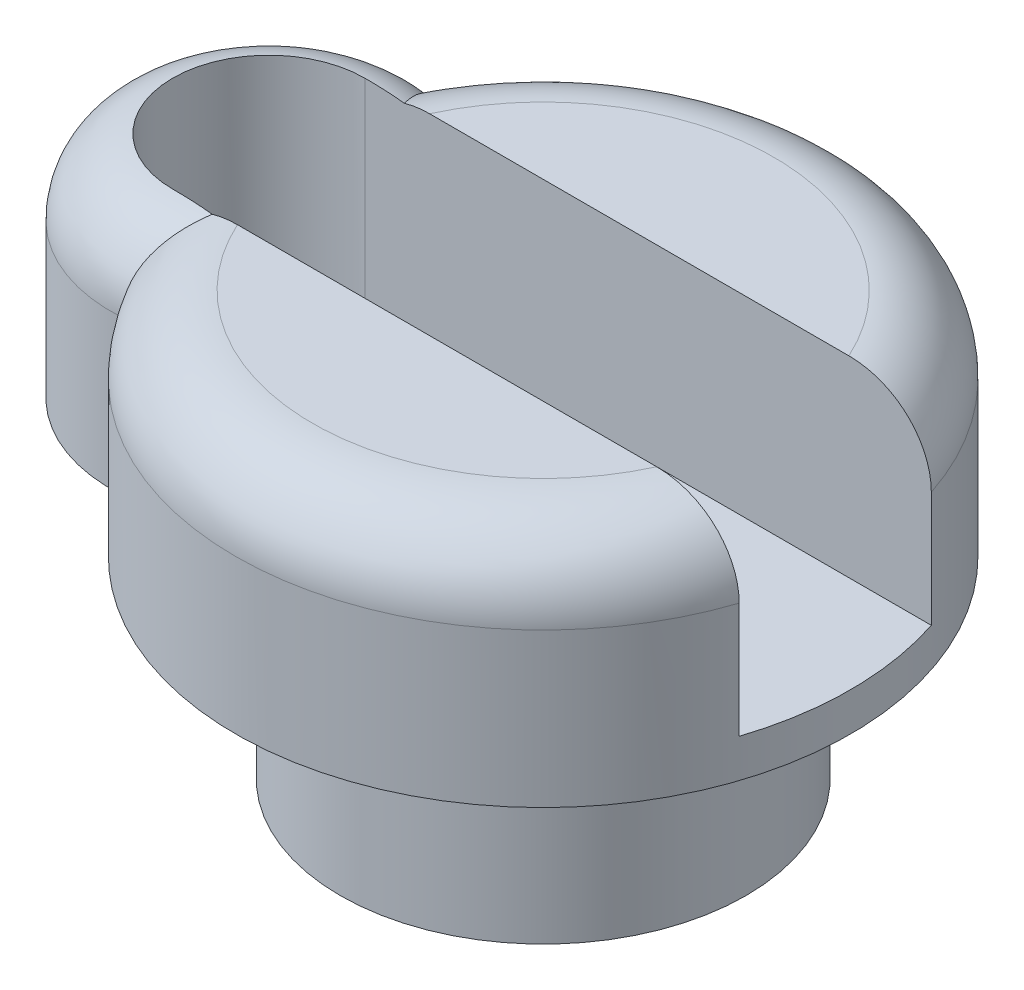
ISO-10303-21;
HEADER;
FILE_DESCRIPTION(('STEP AP214'),'2;1');
FILE_NAME('part.step','',(''),(''),'','','');
FILE_SCHEMA(('AUTOMOTIVE_DESIGN { 1 0 10303 214 1 1 1 1 }'));
ENDSEC;
DATA;
#1=APPLICATION_CONTEXT('core data for automotive mechanical design processes');
#2=APPLICATION_PROTOCOL_DEFINITION('international standard','automotive_design',2000,#1);
#3=PRODUCT_CONTEXT('',#1,'mechanical');
#4=PRODUCT('Part','Part','',(#3));
#5=PRODUCT_RELATED_PRODUCT_CATEGORY('part','',(#4));
#6=PRODUCT_DEFINITION_FORMATION('','',#4);
#7=PRODUCT_DEFINITION_CONTEXT('part definition',#1,'design');
#8=PRODUCT_DEFINITION('design','',#6,#7);
#9=PRODUCT_DEFINITION_SHAPE('','',#8);
#10=(LENGTH_UNIT() NAMED_UNIT(*) SI_UNIT(.MILLI.,.METRE.));
#11=(NAMED_UNIT(*) PLANE_ANGLE_UNIT() SI_UNIT($,.RADIAN.));
#12=(NAMED_UNIT(*) SI_UNIT($,.STERADIAN.) SOLID_ANGLE_UNIT());
#13=UNCERTAINTY_MEASURE_WITH_UNIT(LENGTH_MEASURE(1.E-05),#10,'distance_accuracy_value','');
#14=(GEOMETRIC_REPRESENTATION_CONTEXT(3) GLOBAL_UNCERTAINTY_ASSIGNED_CONTEXT((#13)) GLOBAL_UNIT_ASSIGNED_CONTEXT((#10,
#11,#12)) REPRESENTATION_CONTEXT('',''));
#15=CARTESIAN_POINT('',(0.,0.,0.));
#16=DIRECTION('',(0.,0.,1.));
#17=DIRECTION('',(1.,0.,0.));
#18=AXIS2_PLACEMENT_3D('',#15,#16,#17);
#19=CARTESIAN_POINT('',(0.,6.985,0.));
#20=DIRECTION('',(0.,1.,0.));
#21=DIRECTION('',(0.,0.,1.));
#22=AXIS2_PLACEMENT_3D('',#19,#20,#21);
#23=PLANE('',#22);
#24=DIRECTION('',(1.,0.,0.));
#25=VECTOR('',#24,1.);
#26=CARTESIAN_POINT('',(0.,6.985,-1.5875));
#27=LINE('',#26,#25);
#28=CARTESIAN_POINT('',(-3.46351609639684,6.985,-1.5875));
#29=VERTEX_POINT('',#28);
#30=CARTESIAN_POINT('',(3.46351609639684,6.985,-1.5875));
#31=VERTEX_POINT('',#30);
#32=EDGE_CURVE('E161',#29,#31,#27,.T.);
#33=ORIENTED_EDGE('',*,*,#32,.T.);
#34=CARTESIAN_POINT('',(0.,6.985,0.));
#35=DIRECTION('',(0.,1.,0.));
#36=DIRECTION('',(0.,0.,1.));
#37=AXIS2_PLACEMENT_3D('',#34,#35,#36);
#38=CIRCLE('',#37,3.81);
#39=EDGE_CURVE('E265',#31,#29,#38,.T.);
#40=ORIENTED_EDGE('',*,*,#39,.T.);
#41=EDGE_LOOP('',(#33,#40));
#42=FACE_BOUND('',#41,.T.);
#43=ADVANCED_FACE('F36',(#42),#23,.T.);
#44=CARTESIAN_POINT('',(0.,6.985,0.));
#45=DIRECTION('',(0.,-1.,0.));
#46=DIRECTION('',(0.,0.,-1.));
#47=AXIS2_PLACEMENT_3D('',#44,#45,#46);
#48=CYLINDRICAL_SURFACE('',#47,5.08);
#49=CARTESIAN_POINT('',(0.,3.81,0.));
#50=DIRECTION('',(0.,1.,0.));
#51=DIRECTION('',(0.,0.,1.));
#52=AXIS2_PLACEMENT_3D('',#49,#50,#51);
#53=CIRCLE('',#52,5.08);
#54=CARTESIAN_POINT('',(-4.8349792340776,3.81,-1.5586455036468));
#55=VERTEX_POINT('',#54);
#56=CARTESIAN_POINT('',(-4.8349792340776,3.81,1.5586455036468));
#57=VERTEX_POINT('',#56);
#58=EDGE_CURVE('E150',#55,#57,#53,.T.);
#59=ORIENTED_EDGE('',*,*,#58,.F.);
#60=DIRECTION('',(0.,1.,0.));
#61=VECTOR('',#60,1.);
#62=CARTESIAN_POINT('',(-4.8349792340776,-2.72379220451205,-1.5586455036468));
#63=LINE('',#62,#61);
#64=CARTESIAN_POINT('',(-4.8349792340776,3.175,-1.5586455036468));
#65=VERTEX_POINT('',#64);
#66=EDGE_CURVE('E149',#65,#55,#63,.T.);
#67=ORIENTED_EDGE('',*,*,#66,.F.);
#68=CARTESIAN_POINT('',(0.,3.175,0.));
#69=DIRECTION('',(0.,1.,0.));
#70=DIRECTION('',(0.,0.,1.));
#71=AXIS2_PLACEMENT_3D('',#68,#69,#70);
#72=CIRCLE('',#71,5.08);
#73=CARTESIAN_POINT('',(-4.8349792340776,3.175,1.5586455036468));
#74=VERTEX_POINT('',#73);
#75=EDGE_CURVE('E189',#65,#74,#72,.T.);
#76=ORIENTED_EDGE('',*,*,#75,.T.);
#77=DIRECTION('',(0.,1.,0.));
#78=VECTOR('',#77,1.);
#79=CARTESIAN_POINT('',(-4.8349792340776,-2.72379220451205,1.5586455036468));
#80=LINE('',#79,#78);
#81=EDGE_CURVE('E178',#74,#57,#80,.T.);
#82=ORIENTED_EDGE('',*,*,#81,.T.);
#83=EDGE_LOOP('',(#59,#67,#76,#82));
#84=FACE_BOUND('',#83,.T.);
#85=ADVANCED_FACE('F288',(#84),#48,.T.);
#86=DIRECTION('',(0.,1.,0.));
#87=VECTOR('',#86,1.);
#88=CARTESIAN_POINT('',(-4.36537675030158,-2.72379220451205,-2.59805423883459));
#89=LINE('',#88,#87);
#90=CARTESIAN_POINT('',(-4.36537675030158,3.175,-2.59805423883459));
#91=VERTEX_POINT('',#90);
#92=CARTESIAN_POINT('',(-4.36537675030158,5.715,-2.59805423883459));
#93=VERTEX_POINT('',#92);
#94=EDGE_CURVE('E168',#91,#93,#89,.T.);
#95=ORIENTED_EDGE('',*,*,#94,.T.);
#96=CARTESIAN_POINT('',(0.,5.715,0.));
#97=DIRECTION('',(0.,1.,0.));
#98=DIRECTION('',(0.,0.,1.));
#99=AXIS2_PLACEMENT_3D('',#96,#97,#98);
#100=CIRCLE('',#99,5.08);
#101=CARTESIAN_POINT('',(4.82558221875869,5.715,-1.5875));
#102=VERTEX_POINT('',#101);
#103=EDGE_CURVE('E11',#93,#102,#100,.F.);
#104=ORIENTED_EDGE('',*,*,#103,.T.);
#105=DIRECTION('',(0.,1.,0.));
#106=VECTOR('',#105,1.);
#107=CARTESIAN_POINT('',(4.82558221875869,3.81,-1.5875));
#108=LINE('',#107,#106);
#109=CARTESIAN_POINT('',(4.82558221875869,3.81,-1.5875));
#110=VERTEX_POINT('',#109);
#111=EDGE_CURVE('E166',#110,#102,#108,.T.);
#112=ORIENTED_EDGE('',*,*,#111,.F.);
#113=CARTESIAN_POINT('',(0.,3.81,0.));
#114=DIRECTION('',(0.,1.,0.));
#115=DIRECTION('',(0.,0.,1.));
#116=AXIS2_PLACEMENT_3D('',#113,#114,#115);
#117=CIRCLE('',#116,5.08);
#118=CARTESIAN_POINT('',(4.82558221875869,3.81,1.5875));
#119=VERTEX_POINT('',#118);
#120=EDGE_CURVE('E135',#119,#110,#117,.T.);
#121=ORIENTED_EDGE('',*,*,#120,.F.);
#122=DIRECTION('',(0.,1.,0.));
#123=VECTOR('',#122,1.);
#124=CARTESIAN_POINT('',(4.82558221875869,3.81,1.5875));
#125=LINE('',#124,#123);
#126=CARTESIAN_POINT('',(4.82558221875869,5.715,1.5875));
#127=VERTEX_POINT('',#126);
#128=EDGE_CURVE('E169',#119,#127,#125,.T.);
#129=ORIENTED_EDGE('',*,*,#128,.T.);
#130=CARTESIAN_POINT('',(0.,5.715,0.));
#131=DIRECTION('',(0.,1.,0.));
#132=DIRECTION('',(0.,0.,1.));
#133=AXIS2_PLACEMENT_3D('',#130,#131,#132);
#134=CIRCLE('',#133,5.08);
#135=CARTESIAN_POINT('',(-4.36537675030158,5.715,2.59805423883459));
#136=VERTEX_POINT('',#135);
#137=EDGE_CURVE('E49',#127,#136,#134,.F.);
#138=ORIENTED_EDGE('',*,*,#137,.T.);
#139=DIRECTION('',(0.,1.,0.));
#140=VECTOR('',#139,1.);
#141=CARTESIAN_POINT('',(-4.36537675030158,-2.72379220451205,2.59805423883459));
#142=LINE('',#141,#140);
#143=CARTESIAN_POINT('',(-4.36537675030158,3.175,2.59805423883459));
#144=VERTEX_POINT('',#143);
#145=EDGE_CURVE('E181',#144,#136,#142,.T.);
#146=ORIENTED_EDGE('',*,*,#145,.F.);
#147=EDGE_CURVE('E187',#144,#91,#72,.T.);
#148=ORIENTED_EDGE('',*,*,#147,.T.);
#149=EDGE_LOOP('',(#95,#104,#112,#121,#129,#138,#146,#148));
#150=FACE_BOUND('',#149,.T.);
#151=ADVANCED_FACE('F278',(#150),#48,.T.);
#152=CARTESIAN_POINT('',(0.,0.,0.));
#153=DIRECTION('',(0.,1.,0.));
#154=DIRECTION('',(0.,0.,1.));
#155=AXIS2_PLACEMENT_3D('',#152,#153,#154);
#156=PLANE('',#155);
#157=CARTESIAN_POINT('',(0.,0.,0.));
#158=DIRECTION('',(0.,1.,0.));
#159=DIRECTION('',(0.,0.,1.));
#160=AXIS2_PLACEMENT_3D('',#157,#158,#159);
#161=CIRCLE('',#160,3.3528);
#162=CARTESIAN_POINT('',(0.,0.,3.3528));
#163=VERTEX_POINT('',#162);
#164=EDGE_CURVE('E196',#163,#163,#161,.T.);
#165=ORIENTED_EDGE('',*,*,#164,.F.);
#166=EDGE_LOOP('',(#165));
#167=FACE_BOUND('',#166,.T.);
#168=CARTESIAN_POINT('',(0.,0.,0.));
#169=DIRECTION('',(0.,1.,0.));
#170=DIRECTION('',(0.,0.,1.));
#171=AXIS2_PLACEMENT_3D('',#168,#169,#170);
#172=CIRCLE('',#171,2.4638);
#173=CARTESIAN_POINT('',(0.,0.,2.4638));
#174=VERTEX_POINT('',#173);
#175=EDGE_CURVE('E193',#174,#174,#172,.T.);
#176=ORIENTED_EDGE('',*,*,#175,.T.);
#177=EDGE_LOOP('',(#176));
#178=FACE_BOUND('',#177,.T.);
#179=ADVANCED_FACE('F315',(#167,#178),#156,.F.);
#180=CARTESIAN_POINT('',(0.,3.175,0.));
#181=DIRECTION('',(0.,-1.,0.));
#182=DIRECTION('',(0.,0.,-1.));
#183=AXIS2_PLACEMENT_3D('',#180,#181,#182);
#184=CYLINDRICAL_SURFACE('',#183,3.3528);
#185=CARTESIAN_POINT('',(0.,3.175,0.));
#186=DIRECTION('',(0.,1.,0.));
#187=DIRECTION('',(0.,0.,1.));
#188=AXIS2_PLACEMENT_3D('',#185,#186,#187);
#189=CIRCLE('',#188,3.3528);
#190=CARTESIAN_POINT('',(0.,3.175,3.3528));
#191=VERTEX_POINT('',#190);
#192=EDGE_CURVE('E197',#191,#191,#189,.T.);
#193=ORIENTED_EDGE('',*,*,#192,.F.);
#194=EDGE_LOOP('',(#193));
#195=FACE_BOUND('',#194,.T.);
#196=ORIENTED_EDGE('',*,*,#164,.T.);
#197=EDGE_LOOP('',(#196));
#198=FACE_BOUND('',#197,.T.);
#199=ADVANCED_FACE('F310',(#195,#198),#184,.T.);
#200=CARTESIAN_POINT('',(0.,3.175,0.));
#201=DIRECTION('',(0.,-1.,0.));
#202=DIRECTION('',(0.,0.,-1.));
#203=AXIS2_PLACEMENT_3D('',#200,#201,#202);
#204=CYLINDRICAL_SURFACE('',#203,2.4638);
#205=CARTESIAN_POINT('',(0.,3.175,0.));
#206=DIRECTION('',(0.,1.,0.));
#207=DIRECTION('',(0.,0.,1.));
#208=AXIS2_PLACEMENT_3D('',#205,#206,#207);
#209=CIRCLE('',#208,2.4638);
#210=CARTESIAN_POINT('',(0.,3.175,2.4638));
#211=VERTEX_POINT('',#210);
#212=EDGE_CURVE('E190',#211,#211,#209,.T.);
#213=ORIENTED_EDGE('',*,*,#212,.T.);
#214=EDGE_LOOP('',(#213));
#215=FACE_BOUND('',#214,.T.);
#216=ORIENTED_EDGE('',*,*,#175,.F.);
#217=EDGE_LOOP('',(#216));
#218=FACE_BOUND('',#217,.T.);
#219=ADVANCED_FACE('F305',(#215,#218),#204,.F.);
#220=CARTESIAN_POINT('',(0.,3.175,0.));
#221=DIRECTION('',(0.,1.,0.));
#222=DIRECTION('',(0.,0.,1.));
#223=AXIS2_PLACEMENT_3D('',#220,#221,#222);
#224=PLANE('',#223);
#225=ORIENTED_EDGE('',*,*,#212,.F.);
#226=EDGE_LOOP('',(#225));
#227=FACE_BOUND('',#226,.T.);
#228=ADVANCED_FACE('F299',(#227),#224,.F.);
#229=DIRECTION('',(1.,0.,0.));
#230=VECTOR('',#229,1.);
#231=CARTESIAN_POINT('',(0.,6.985,1.5875));
#232=LINE('',#231,#230);
#233=CARTESIAN_POINT('',(-3.46351609639684,6.985,1.5875));
#234=VERTEX_POINT('',#233);
#235=CARTESIAN_POINT('',(3.46351609639684,6.985,1.5875));
#236=VERTEX_POINT('',#235);
#237=EDGE_CURVE('E143',#234,#236,#232,.T.);
#238=ORIENTED_EDGE('',*,*,#237,.F.);
#239=CARTESIAN_POINT('',(0.,6.985,0.));
#240=DIRECTION('',(0.,1.,0.));
#241=DIRECTION('',(0.,0.,1.));
#242=AXIS2_PLACEMENT_3D('',#239,#240,#241);
#243=CIRCLE('',#242,3.81);
#244=EDGE_CURVE('E250',#234,#236,#243,.T.);
#245=ORIENTED_EDGE('',*,*,#244,.T.);
#246=EDGE_LOOP('',(#238,#245));
#247=FACE_BOUND('',#246,.T.);
#248=ADVANCED_FACE('F271',(#247),#23,.T.);
#249=ORIENTED_EDGE('',*,*,#75,.F.);
#250=CARTESIAN_POINT('',(-4.53368130185499,3.175,0.));
#251=DIRECTION('',(0.,1.,0.));
#252=DIRECTION('',(0.,0.,1.));
#253=AXIS2_PLACEMENT_3D('',#250,#251,#252);
#254=CIRCLE('',#253,1.5875);
#255=EDGE_CURVE('E174',#74,#65,#254,.F.);
#256=ORIENTED_EDGE('',*,*,#255,.F.);
#257=EDGE_LOOP('',(#249,#256));
#258=FACE_BOUND('',#257,.T.);
#259=ORIENTED_EDGE('',*,*,#192,.T.);
#260=EDGE_LOOP('',(#259));
#261=FACE_BOUND('',#260,.T.);
#262=CARTESIAN_POINT('',(-4.53368130185499,3.175,0.));
#263=DIRECTION('',(0.,1.,0.));
#264=DIRECTION('',(0.,0.,1.));
#265=AXIS2_PLACEMENT_3D('',#262,#263,#264);
#266=CIRCLE('',#265,2.6035);
#267=EDGE_CURVE('E176',#144,#91,#266,.F.);
#268=ORIENTED_EDGE('',*,*,#267,.T.);
#269=ORIENTED_EDGE('',*,*,#147,.F.);
#270=EDGE_LOOP('',(#268,#269));
#271=FACE_BOUND('',#270,.T.);
#272=ADVANCED_FACE('F298',(#258,#261,#271),#224,.F.);
#273=CARTESIAN_POINT('',(-4.53368130185499,-2.72379220451205,0.));
#274=DIRECTION('',(0.,1.,0.));
#275=DIRECTION('',(0.,0.,1.));
#276=AXIS2_PLACEMENT_3D('',#273,#274,#275);
#277=CYLINDRICAL_SURFACE('',#276,1.5875);
#278=DIRECTION('',(0.,1.,0.));
#279=VECTOR('',#278,1.);
#280=CARTESIAN_POINT('',(-4.53368130185499,3.81,-1.5875));
#281=LINE('',#280,#279);
#282=CARTESIAN_POINT('',(-4.53368130185499,3.81,-1.5875));
#283=VERTEX_POINT('',#282);
#284=CARTESIAN_POINT('',(-4.53368130185499,6.95934078933385,-1.5875));
#285=VERTEX_POINT('',#284);
#286=EDGE_CURVE('E124',#283,#285,#281,.T.);
#287=ORIENTED_EDGE('',*,*,#286,.T.);
#288=CARTESIAN_POINT('',(-4.53368130185499,6.95934078933386,0.));
#289=DIRECTION('',(0.,1.,0.));
#290=DIRECTION('',(0.,0.,1.));
#291=AXIS2_PLACEMENT_3D('',#288,#289,#290);
#292=CIRCLE('',#291,1.5875);
#293=CARTESIAN_POINT('',(-4.53368130185499,6.95934078933385,1.5875));
#294=VERTEX_POINT('',#293);
#295=EDGE_CURVE('E200',#285,#294,#292,.T.);
#296=ORIENTED_EDGE('',*,*,#295,.T.);
#297=DIRECTION('',(0.,1.,0.));
#298=VECTOR('',#297,1.);
#299=CARTESIAN_POINT('',(-4.53368130185499,3.81,1.5875));
#300=LINE('',#299,#298);
#301=CARTESIAN_POINT('',(-4.53368130185499,3.81,1.5875));
#302=VERTEX_POINT('',#301);
#303=EDGE_CURVE('E134',#302,#294,#300,.T.);
#304=ORIENTED_EDGE('',*,*,#303,.F.);
#305=CARTESIAN_POINT('',(-4.53368130185499,3.81,0.));
#306=DIRECTION('',(0.,1.,0.));
#307=DIRECTION('',(0.,0.,1.));
#308=AXIS2_PLACEMENT_3D('',#305,#306,#307);
#309=CIRCLE('',#308,1.5875);
#310=EDGE_CURVE('E152',#57,#302,#309,.T.);
#311=ORIENTED_EDGE('',*,*,#310,.F.);
#312=ORIENTED_EDGE('',*,*,#81,.F.);
#313=ORIENTED_EDGE('',*,*,#255,.T.);
#314=ORIENTED_EDGE('',*,*,#66,.T.);
#315=EDGE_CURVE('E139',#283,#55,#309,.T.);
#316=ORIENTED_EDGE('',*,*,#315,.F.);
#317=EDGE_LOOP('',(#287,#296,#304,#311,#312,#313,#314,#316));
#318=FACE_BOUND('',#317,.T.);
#319=ADVANCED_FACE('F146',(#318),#277,.F.);
#320=CARTESIAN_POINT('',(-4.53368130185499,-2.72379220451205,0.));
#321=DIRECTION('',(0.,1.,0.));
#322=DIRECTION('',(0.,0.,1.));
#323=AXIS2_PLACEMENT_3D('',#320,#321,#322);
#324=CYLINDRICAL_SURFACE('',#323,2.6035);
#325=ORIENTED_EDGE('',*,*,#145,.T.);
#326=CARTESIAN_POINT('',(-4.53368130185499,5.715,0.));
#327=DIRECTION('',(0.,1.,0.));
#328=DIRECTION('',(0.,0.,1.));
#329=AXIS2_PLACEMENT_3D('',#326,#327,#328);
#330=CIRCLE('',#329,2.6035);
#331=EDGE_CURVE('E234',#136,#93,#330,.F.);
#332=ORIENTED_EDGE('',*,*,#331,.T.);
#333=ORIENTED_EDGE('',*,*,#94,.F.);
#334=ORIENTED_EDGE('',*,*,#267,.F.);
#335=EDGE_LOOP('',(#325,#332,#333,#334));
#336=FACE_BOUND('',#335,.T.);
#337=ADVANCED_FACE('F282',(#336),#324,.T.);
#338=CARTESIAN_POINT('',(0.,3.81,-1.5875));
#339=DIRECTION('',(0.,0.,1.));
#340=DIRECTION('',(1.,0.,0.));
#341=AXIS2_PLACEMENT_3D('',#338,#339,#340);
#342=PLANE('',#341);
#343=CARTESIAN_POINT('',(-3.46351609639684,6.985,-1.5875));
#344=CARTESIAN_POINT('',(-3.50436292904681,6.98499835109791,-1.5875));
#345=CARTESIAN_POINT('',(-3.54519436459593,6.98337017029803,-1.5875));
#346=CARTESIAN_POINT('',(-3.62660550786249,6.97680660331245,-1.5875));
#347=CARTESIAN_POINT('',(-3.66718511186266,6.97186993534326,-1.5875));
#348=CARTESIAN_POINT('',(-3.78841445410829,6.95197716394008,-1.5875));
#349=CARTESIAN_POINT('',(-3.86830094058204,6.9319375821412,-1.5875));
#350=CARTESIAN_POINT('',(-4.02361538311296,6.87828614970619,-1.5875));
#351=CARTESIAN_POINT('',(-4.09902990256799,6.84463555933872,-1.5875));
#352=CARTESIAN_POINT('',(-4.24237889530912,6.76434942285244,-1.5875));
#353=CARTESIAN_POINT('',(-4.31033829020683,6.71775910018592,-1.5875));
#354=CARTESIAN_POINT('',(-4.40228126088642,6.64114999655066,-1.5875));
#355=CARTESIAN_POINT('',(-4.43021093047367,6.6157498318809,-1.5875));
#356=CARTESIAN_POINT('',(-4.48374326965185,6.56260244395275,-1.5875));
#357=CARTESIAN_POINT('',(-4.50934576060876,6.53485504083565,-1.5875));
#358=CARTESIAN_POINT('',(-4.53368130185499,6.50600580467677,-1.5875));
#359=B_SPLINE_CURVE_WITH_KNOTS('',3,(#343,#344,#345,#346,#347,#348,#349,#350,#351,#352,#353,
#354,#355,#356,#357,#358),.UNSPECIFIED.,.F.,.F.,(4,2,2,2,2,2,2,4),(0.,0.122474451390476,
0.244996379631254,0.490792418430554,0.737293022157744,0.982942735745719,1.09607629624818,
1.20921853355124),.UNSPECIFIED.);
#360=CARTESIAN_POINT('',(-3.88085268111467,6.92587483684159,-1.5875));
#361=VERTEX_POINT('',#360);
#362=EDGE_CURVE('E57',#29,#361,#359,.T.);
#363=ORIENTED_EDGE('',*,*,#362,.T.);
#364=CARTESIAN_POINT('',(-3.88085268111467,6.92587483684158,-1.58750000000002));
#365=CARTESIAN_POINT('',(-3.935013865799,6.93237228264304,-1.58750000000001));
#366=CARTESIAN_POINT('',(-3.98930152136189,6.9376485874831,-1.5875));
#367=CARTESIAN_POINT('',(-4.09798912487156,6.94622458353965,-1.5875));
#368=CARTESIAN_POINT('',(-4.15238893794505,6.94952595300719,-1.5875));
#369=CARTESIAN_POINT('',(-4.26123456117558,6.95462635675357,-1.5875));
#370=CARTESIAN_POINT('',(-4.31568034994972,6.95642589155575,-1.5875));
#371=CARTESIAN_POINT('',(-4.4246458746136,6.95876755751968,-1.5875));
#372=CARTESIAN_POINT('',(-4.4791656341305,6.95930862611513,-1.5875));
#373=CARTESIAN_POINT('',(-4.53368130185499,6.95934078933385,-1.5875));
#374=B_SPLINE_CURVE_WITH_KNOTS('',3,(#364,#365,#366,#367,#368,#369,#370,#371,#372,#373),
.UNSPECIFIED.,.F.,.F.,(4,2,2,2,4),(0.,0.163606280207561,0.327073333635278,0.490485885865199,
0.654036362923584),.UNSPECIFIED.);
#375=EDGE_CURVE('E130',#361,#285,#374,.T.);
#376=ORIENTED_EDGE('',*,*,#375,.T.);
#377=ORIENTED_EDGE('',*,*,#286,.F.);
#378=DIRECTION('',(1.,0.,0.));
#379=VECTOR('',#378,1.);
#380=CARTESIAN_POINT('',(0.,3.81,-1.5875));
#381=LINE('',#380,#379);
#382=EDGE_CURVE('E127',#283,#110,#381,.T.);
#383=ORIENTED_EDGE('',*,*,#382,.T.);
#384=ORIENTED_EDGE('',*,*,#111,.T.);
#385=CARTESIAN_POINT('',(4.82558221875869,5.715,-1.5875));
#386=CARTESIAN_POINT('',(4.82558267571095,5.74933477298797,-1.5875));
#387=CARTESIAN_POINT('',(4.82411545113711,5.78365273205524,-1.5875));
#388=CARTESIAN_POINT('',(4.81826684077882,5.85203512121483,-1.5875));
#389=CARTESIAN_POINT('',(4.81388582046466,5.88609958256099,-1.5875));
#390=CARTESIAN_POINT('',(4.79643593955077,5.98740643736862,-1.5875));
#391=CARTESIAN_POINT('',(4.77905998084384,6.05395696259415,-1.5875));
#392=CARTESIAN_POINT('',(4.7334138351964,6.18317080386028,-1.5875));
#393=CARTESIAN_POINT('',(4.70514254134846,6.24583372418994,-1.5875));
#394=CARTESIAN_POINT('',(4.63865035856227,6.36564571369844,-1.5875));
#395=CARTESIAN_POINT('',(4.60042792051345,6.42279392249309,-1.5875));
#396=CARTESIAN_POINT('',(4.51451946365495,6.53108311244743,-1.5875));
#397=CARTESIAN_POINT('',(4.46668095012916,6.5821028543751,-1.5875));
#398=CARTESIAN_POINT('',(4.36346360546502,6.67581695015678,-1.5875));
#399=CARTESIAN_POINT('',(4.30808406340635,6.71851051814788,-1.5875));
#400=CARTESIAN_POINT('',(4.1886311872105,6.79656208923598,-1.5875));
#401=CARTESIAN_POINT('',(4.12427164970767,6.83148124307587,-1.5875));
#402=CARTESIAN_POINT('',(3.99084107455645,6.89079437881489,-1.5875));
#403=CARTESIAN_POINT('',(3.92176695914347,6.91518140755056,-1.5875));
#404=CARTESIAN_POINT('',(3.78807868395027,6.95123350911539,-1.5875));
#405=CARTESIAN_POINT('',(3.72374461052227,6.96395542893966,-1.5875));
#406=CARTESIAN_POINT('',(3.59410223290534,6.98084012412007,-1.5875));
#407=CARTESIAN_POINT('',(3.5287963945175,6.98502174316628,-1.5875));
#408=CARTESIAN_POINT('',(3.46351609639684,6.985,-1.5875));
#409=B_SPLINE_CURVE_WITH_KNOTS('',3,(#385,#386,#387,#388,#389,#390,#391,#392,#393,#394,#395,
#396,#397,#398,#399,#400,#401,#402,#403,#404,#405,#406,#407,#408),.UNSPECIFIED.,.F.,.F.,(4,2,2,
2,2,2,2,2,2,2,2,4),(0.,0.102939775469049,0.205866641887426,0.41114397322845,0.616442165142041,
0.821772335283652,1.03066012457471,1.23956762013255,1.45828948992611,1.67715553695915,
1.87333000891728,2.0690711633321),.UNSPECIFIED.);
#410=EDGE_CURVE('E237',#102,#31,#409,.T.);
#411=ORIENTED_EDGE('',*,*,#410,.T.);
#412=ORIENTED_EDGE('',*,*,#32,.F.);
#413=EDGE_LOOP('',(#363,#376,#377,#383,#384,#411,#412));
#414=FACE_BOUND('',#413,.T.);
#415=ADVANCED_FACE('F126',(#414),#342,.T.);
#416=CARTESIAN_POINT('',(0.,3.81,1.5875));
#417=DIRECTION('',(0.,0.,1.));
#418=DIRECTION('',(1.,0.,0.));
#419=AXIS2_PLACEMENT_3D('',#416,#417,#418);
#420=PLANE('',#419);
#421=ORIENTED_EDGE('',*,*,#237,.T.);
#422=CARTESIAN_POINT('',(3.46351609639684,6.985,1.5875));
#423=CARTESIAN_POINT('',(3.50438994732627,6.98499862683241,1.5875));
#424=CARTESIAN_POINT('',(3.54524882815054,6.98336812735593,1.5875));
#425=CARTESIAN_POINT('',(3.62671307232126,6.97679557361854,1.5875));
#426=CARTESIAN_POINT('',(3.66731834002171,6.97185233812683,1.5875));
#427=CARTESIAN_POINT('',(3.78851792300516,6.95195164374158,1.5875));
#428=CARTESIAN_POINT('',(3.86834872869411,6.93192280472908,1.5875));
#429=CARTESIAN_POINT('',(4.02354128707349,6.87831001048717,1.5875));
#430=CARTESIAN_POINT('',(4.09889122809065,6.84469190563668,1.5875));
#431=CARTESIAN_POINT('',(4.24223347716369,6.76445205940348,1.5875));
#432=CARTESIAN_POINT('',(4.3102365295939,6.7178496740004,1.5875));
#433=CARTESIAN_POINT('',(4.4322518367512,6.61617237975524,1.5875));
#434=CARTESIAN_POINT('',(4.48688550756237,6.56184318570165,1.5875));
#435=CARTESIAN_POINT('',(4.58550248362647,6.44419212285872,1.5875));
#436=CARTESIAN_POINT('',(4.62948423023632,6.3808689401718,1.5875));
#437=CARTESIAN_POINT('',(4.70255638059095,6.25155768758794,1.5875));
#438=CARTESIAN_POINT('',(4.7324283785089,6.18600975822395,1.5875));
#439=CARTESIAN_POINT('',(4.78018203168132,6.05073132314294,1.5875));
#440=CARTESIAN_POINT('',(4.79808143400275,5.9810071757782,1.5875));
#441=CARTESIAN_POINT('',(4.8149692627793,5.87802708023672,1.5875));
#442=CARTESIAN_POINT('',(4.81894878387423,5.8455228443278,1.5875));
#443=CARTESIAN_POINT('',(4.82425279777923,5.78035126268347,1.5875));
#444=CARTESIAN_POINT('',(4.82558156419341,5.74768426475445,1.5875));
#445=CARTESIAN_POINT('',(4.82558221875869,5.715,1.5875));
#446=B_SPLINE_CURVE_WITH_KNOTS('',3,(#422,#423,#424,#425,#426,#427,#428,#429,#430,#431,#432,
#433,#434,#435,#436,#437,#438,#439,#440,#441,#442,#443,#444,#445),.UNSPECIFIED.,.F.,.F.,(4,2,2,
2,2,2,2,2,2,2,2,4),(0.,0.122556287494602,0.245156298468135,0.490792854321205,0.737050567209754,
0.982943124061057,1.21288473393514,1.44285996972033,1.65789985333621,1.87262027114232,
1.97077021180864,2.06876178471559),.UNSPECIFIED.);
#447=EDGE_CURVE('E229',#236,#127,#446,.T.);
#448=ORIENTED_EDGE('',*,*,#447,.T.);
#449=ORIENTED_EDGE('',*,*,#128,.F.);
#450=DIRECTION('',(1.,0.,0.));
#451=VECTOR('',#450,1.);
#452=CARTESIAN_POINT('',(0.,3.81,1.5875));
#453=LINE('',#452,#451);
#454=EDGE_CURVE('E155',#302,#119,#453,.T.);
#455=ORIENTED_EDGE('',*,*,#454,.F.);
#456=ORIENTED_EDGE('',*,*,#303,.T.);
#457=CARTESIAN_POINT('',(-4.53368130185499,6.95934078933385,1.5875));
#458=CARTESIAN_POINT('',(-4.4791656341305,6.95930862611513,1.5875));
#459=CARTESIAN_POINT('',(-4.42464587461359,6.95876755751968,1.5875));
#460=CARTESIAN_POINT('',(-4.31568034994972,6.95642589155575,1.5875));
#461=CARTESIAN_POINT('',(-4.26123456117558,6.95462635675357,1.5875));
#462=CARTESIAN_POINT('',(-4.15238893794504,6.94952595300719,1.5875));
#463=CARTESIAN_POINT('',(-4.09798912487156,6.94622458353965,1.5875));
#464=CARTESIAN_POINT('',(-3.98930152136189,6.9376485874831,1.5875));
#465=CARTESIAN_POINT('',(-3.93501386579899,6.93237228264304,1.5875));
#466=CARTESIAN_POINT('',(-3.88085268111466,6.92587483684158,1.5875));
#467=B_SPLINE_CURVE_WITH_KNOTS('',3,(#457,#458,#459,#460,#461,#462,#463,#464,#465,#466),
.UNSPECIFIED.,.F.,.F.,(4,2,2,2,4),(0.,0.163550477058388,0.32696302928831,0.490430082716027,
0.654036362923591),.UNSPECIFIED.);
#468=CARTESIAN_POINT('',(-3.88085268111447,6.92587483684165,1.5875));
#469=VERTEX_POINT('',#468);
#470=EDGE_CURVE('E211',#294,#469,#467,.T.);
#471=ORIENTED_EDGE('',*,*,#470,.T.);
#472=CARTESIAN_POINT('',(-4.53368130185499,6.50600580467677,1.5875));
#473=CARTESIAN_POINT('',(-4.50947085562419,6.5347085167713,1.5875));
#474=CARTESIAN_POINT('',(-4.48400298673758,6.5623217147355,1.5875));
#475=CARTESIAN_POINT('',(-4.43076990133077,6.61521743327154,1.5875));
#476=CARTESIAN_POINT('',(-4.40300553461673,6.64050080872411,1.5875));
#477=CARTESIAN_POINT('',(-4.316837179803,6.71243263937628,1.5875));
#478=CARTESIAN_POINT('',(-4.25532567859412,6.75543594948708,1.5875));
#479=CARTESIAN_POINT('',(-4.12617916544695,6.83065267792031,1.5875));
#480=CARTESIAN_POINT('',(-4.05854982645492,6.86287596465321,1.5875));
#481=CARTESIAN_POINT('',(-3.9189745887231,6.91621001179108,1.5875));
#482=CARTESIAN_POINT('',(-3.84702523418901,6.93731173994929,1.5875));
#483=CARTESIAN_POINT('',(-3.72287250696261,6.96359500406795,1.5875));
#484=CARTESIAN_POINT('',(-3.67125399243865,6.97165800108812,1.5875));
#485=CARTESIAN_POINT('',(-3.56759608380263,6.98235534589361,1.5875));
#486=CARTESIAN_POINT('',(-3.51555820226324,6.9850042914737,1.5875));
#487=CARTESIAN_POINT('',(-3.46351609639684,6.985,1.5875));
#488=B_SPLINE_CURVE_WITH_KNOTS('',3,(#472,#473,#474,#475,#476,#477,#478,#479,#480,#481,#482,
#483,#484,#485,#486,#487),.UNSPECIFIED.,.F.,.F.,(4,2,2,2,2,2,2,4),(0.,0.112571318289053,
0.225101164972678,0.44909959541008,0.672892405123168,0.896866686630846,1.05333249648699,
1.20937587128812),.UNSPECIFIED.);
#489=EDGE_CURVE('E204',#469,#234,#488,.T.);
#490=ORIENTED_EDGE('',*,*,#489,.T.);
#491=EDGE_LOOP('',(#421,#448,#449,#455,#456,#471,#490));
#492=FACE_BOUND('',#491,.T.);
#493=ADVANCED_FACE('F219',(#492),#420,.F.);
#494=CARTESIAN_POINT('',(0.,3.81,0.));
#495=DIRECTION('',(0.,1.,0.));
#496=DIRECTION('',(0.,0.,1.));
#497=AXIS2_PLACEMENT_3D('',#494,#495,#496);
#498=PLANE('',#497);
#499=ORIENTED_EDGE('',*,*,#382,.F.);
#500=ORIENTED_EDGE('',*,*,#315,.T.);
#501=ORIENTED_EDGE('',*,*,#58,.T.);
#502=ORIENTED_EDGE('',*,*,#310,.T.);
#503=ORIENTED_EDGE('',*,*,#454,.T.);
#504=ORIENTED_EDGE('',*,*,#120,.T.);
#505=EDGE_LOOP('',(#499,#500,#501,#502,#503,#504));
#506=FACE_BOUND('',#505,.T.);
#507=ADVANCED_FACE('F138',(#506),#498,.T.);
#508=CARTESIAN_POINT('',(0.,5.715,0.));
#509=DIRECTION('',(0.,1.,0.));
#510=DIRECTION('',(0.,0.,1.));
#511=AXIS2_PLACEMENT_3D('',#508,#509,#510);
#512=TOROIDAL_SURFACE('',#511,3.81,1.27);
#513=ORIENTED_EDGE('',*,*,#410,.F.);
#514=ORIENTED_EDGE('',*,*,#103,.F.);
#515=CARTESIAN_POINT('',(-3.67164580835973,6.985,-1.01740702668814));
#516=CARTESIAN_POINT('',(-3.67237975431525,6.98500000700137,-1.01978995140764));
#517=CARTESIAN_POINT('',(-3.67311554077747,6.98499787425898,-1.02217234900823));
#518=CARTESIAN_POINT('',(-3.69433434147686,6.98487408737989,-1.09069107194818));
#519=CARTESIAN_POINT('',(-3.71622392658309,6.98308125575118,-1.15641710193362));
#520=CARTESIAN_POINT('',(-3.76222863221431,6.9748378785892,-1.2867990816127));
#521=CARTESIAN_POINT('',(-3.78634365313077,6.9683875414336,-1.35145507904743));
#522=CARTESIAN_POINT('',(-3.8361724894052,6.949644652318,-1.47930271480746));
#523=CARTESIAN_POINT('',(-3.86188582805533,6.93735383511789,-1.54249478211323));
#524=CARTESIAN_POINT('',(-3.91418331572137,6.90592117316743,-1.66673603725106));
#525=CARTESIAN_POINT('',(-3.94076662461235,6.88678577058892,-1.72778718100499));
#526=CARTESIAN_POINT('',(-3.99831953578145,6.83712489489887,-1.85654299333911));
#527=CARTESIAN_POINT('',(-4.02930687133999,6.8052623894808,-1.92373826149075));
#528=CARTESIAN_POINT('',(-4.08993951948699,6.73037457382442,-2.05230766174344));
#529=CARTESIAN_POINT('',(-4.11958542893011,6.68735428665155,-2.11368439632622));
#530=CARTESIAN_POINT('',(-4.17615816382033,6.58962567883963,-2.22893130758044));
#531=CARTESIAN_POINT('',(-4.203059852106,6.53482151595485,-2.28273355435334));
#532=CARTESIAN_POINT('',(-4.25208356853303,6.41457311992117,-2.37968909738348));
#533=CARTESIAN_POINT('',(-4.27420719134545,6.34913244950725,-2.42284594720905));
#534=CARTESIAN_POINT('',(-4.30971654752993,6.21811406983071,-2.49163561205486));
#535=CARTESIAN_POINT('',(-4.32383674437398,6.15351622590809,-2.51875925841206));
#536=CARTESIAN_POINT('',(-4.34618106861437,6.01976755021714,-2.56153802241244));
#537=CARTESIAN_POINT('',(-4.35442119790264,5.95062963870165,-2.57722426811418));
#538=CARTESIAN_POINT('',(-4.36142631452184,5.85315358564211,-2.59054798773433));
#539=CARTESIAN_POINT('',(-4.36290538648814,5.82562337300879,-2.59335911410774));
#540=CARTESIAN_POINT('',(-4.3648810482461,5.77040008975197,-2.59711295297575));
#541=CARTESIAN_POINT('',(-4.3653776689254,5.74270702427593,-2.59805572421025));
#542=CARTESIAN_POINT('',(-4.36537466895792,5.65222366212854,-2.5980508733904));
#543=CARTESIAN_POINT('',(-4.36281847773348,5.58937566698602,-2.59320018207097));
#544=CARTESIAN_POINT('',(-4.35272003937608,5.46549581061148,-2.57398235546509));
#545=CARTESIAN_POINT('',(-4.34516885550076,5.40446740978977,-2.55959816331845));
#546=CARTESIAN_POINT('',(-4.32550511018792,5.28618542876016,-2.52195525779529));
#547=CARTESIAN_POINT('',(-4.31340504360165,5.22892200859049,-2.49872085185657));
#548=CARTESIAN_POINT('',(-4.285254351163,5.11942249563331,-2.44428514567701));
#549=CARTESIAN_POINT('',(-4.26920469579066,5.06718517222914,-2.41308580248416));
#550=CARTESIAN_POINT('',(-4.23322813757841,4.96687580318111,-2.3424946677594));
#551=CARTESIAN_POINT('',(-4.21317776304398,4.91903536936753,-2.30283812188327));
#552=CARTESIAN_POINT('',(-4.17052194901681,4.83052171906617,-2.21740930323201));
#553=CARTESIAN_POINT('',(-4.14791572270656,4.78985071959982,-2.1716351463598));
#554=CARTESIAN_POINT('',(-4.0981947097129,4.71142221156416,-2.06935535378472));
#555=CARTESIAN_POINT('',(-4.07086619552354,4.67462352500054,-2.01222171410163));
#556=CARTESIAN_POINT('',(-4.01531926088602,4.61015021339648,-1.89341947828948));
#557=CARTESIAN_POINT('',(-3.98710014246029,4.5824829496095,-1.83174727215502));
#558=CARTESIAN_POINT('',(-3.93484015580542,4.53894556727973,-1.7141686005408));
#559=CARTESIAN_POINT('',(-3.91077199983626,4.52196123877903,-1.6586777957134));
#560=CARTESIAN_POINT('',(-3.86336493571292,4.49360534158882,-1.54596078464107));
#561=CARTESIAN_POINT('',(-3.84002657581746,4.48223790199207,-1.48873333445568));
#562=CARTESIAN_POINT('',(-3.77191068672703,4.45547243943613,-1.31517725162173));
#563=CARTESIAN_POINT('',(-3.72901445519795,4.44739800874675,-1.19693564503093));
#564=CARTESIAN_POINT('',(-3.68489626644779,4.44518846072702,-1.05986033575753));
#565=CARTESIAN_POINT('',(-3.67932508027783,4.44503820544206,-1.04222391837922));
#566=CARTESIAN_POINT('',(-3.67311556640543,4.44500214552982,-1.02217242834974));
#567=CARTESIAN_POINT('',(-3.67237978236693,4.44500001492559,-1.01979003812581));
#568=CARTESIAN_POINT('',(-3.67164580835973,4.445,-1.01740702668814));
#569=B_SPLINE_CURVE_WITH_KNOTS('',3,(#515,#516,#517,#518,#519,#520,#521,#522,#523,#524,#525,
#526,#527,#528,#529,#530,#531,#532,#533,#534,#535,#536,#537,#538,#539,#540,#541,#542,#543,#544,
#545,#546,#547,#548,#549,#550,#551,#552,#553,#554,#555,#556,#557,#558,#559,#560,#561,#562,#563,
#564,#565,#566,#567,#568),.UNSPECIFIED.,.F.,.F.,(4,2,2,2,2,2,2,2,2,2,2,2,2,2,2,2,2,2,2,2,2,2,2,
2,2,2,4),(0.,0.00748028735519628,0.215184232143868,0.422878884794725,0.630511885773981,
0.837949973133561,1.07875544473909,1.3194526969455,1.5621871376397,1.80484044051418,
2.01805430979388,2.23068570733162,2.31376068777748,2.39683305635745,2.58505171982069,
2.77360804699838,2.96165018844429,3.14964617084542,3.34473740520517,3.53988886266919,
3.75881881958858,3.97792483721615,4.16608937450822,4.35439203046674,4.73086375183786,
4.78635761275462,4.79383790010982),.UNSPECIFIED.);
#570=EDGE_CURVE('E41',#361,#93,#569,.T.);
#571=ORIENTED_EDGE('',*,*,#570,.F.);
#572=ORIENTED_EDGE('',*,*,#362,.F.);
#573=ORIENTED_EDGE('',*,*,#39,.F.);
#574=EDGE_LOOP('',(#513,#514,#571,#572,#573));
#575=FACE_BOUND('',#574,.T.);
#576=ADVANCED_FACE('F38',(#575),#512,.T.);
#577=CARTESIAN_POINT('',(0.,5.715,0.));
#578=DIRECTION('',(0.,1.,0.));
#579=DIRECTION('',(0.,0.,1.));
#580=AXIS2_PLACEMENT_3D('',#577,#578,#579);
#581=TOROIDAL_SURFACE('',#580,3.81,1.27);
#582=ORIENTED_EDGE('',*,*,#244,.F.);
#583=ORIENTED_EDGE('',*,*,#489,.F.);
#584=CARTESIAN_POINT('',(-3.67164580835973,4.445,1.01740702668814));
#585=CARTESIAN_POINT('',(-3.67237975431525,4.44499999299863,1.01978995140764));
#586=CARTESIAN_POINT('',(-3.67311554077747,4.44500212574101,1.02217234900823));
#587=CARTESIAN_POINT('',(-3.69433434147686,4.44512591262011,1.09069107194818));
#588=CARTESIAN_POINT('',(-3.71622392658309,4.44691874424881,1.15641710193361));
#589=CARTESIAN_POINT('',(-3.76222863221431,4.45516212141079,1.2867990816127));
#590=CARTESIAN_POINT('',(-3.78634365313077,4.4616124585664,1.35145507904743));
#591=CARTESIAN_POINT('',(-3.8361724894052,4.480355347682,1.47930271480746));
#592=CARTESIAN_POINT('',(-3.86188582805533,4.49264616488211,1.54249478211323));
#593=CARTESIAN_POINT('',(-3.91418331572137,4.52407882683257,1.66673603725106));
#594=CARTESIAN_POINT('',(-3.94076662461235,4.54321422941107,1.72778718100499));
#595=CARTESIAN_POINT('',(-3.99831953578145,4.59287510510113,1.85654299333911));
#596=CARTESIAN_POINT('',(-4.02930687133998,4.6247376105192,1.92373826149075));
#597=CARTESIAN_POINT('',(-4.08993951948698,4.69962542617558,2.05230766174344));
#598=CARTESIAN_POINT('',(-4.11958542893011,4.74264571334845,2.11368439632622));
#599=CARTESIAN_POINT('',(-4.17615816382033,4.84037432116037,2.22893130758044));
#600=CARTESIAN_POINT('',(-4.203059852106,4.89517848404515,2.28273355435334));
#601=CARTESIAN_POINT('',(-4.25208356853303,5.01542688007882,2.37968909738348));
#602=CARTESIAN_POINT('',(-4.27420719134545,5.08086755049275,2.42284594720905));
#603=CARTESIAN_POINT('',(-4.30971654752993,5.21188593016929,2.49163561205486));
#604=CARTESIAN_POINT('',(-4.32383674437398,5.27648377409191,2.51875925841206));
#605=CARTESIAN_POINT('',(-4.34618106861437,5.41023244978286,2.56153802241244));
#606=CARTESIAN_POINT('',(-4.35442119790264,5.47937036129835,2.57722426811418));
#607=CARTESIAN_POINT('',(-4.36142631452184,5.57684641435789,2.59054798773433));
#608=CARTESIAN_POINT('',(-4.36290538648814,5.60437662699121,2.59335911410774));
#609=CARTESIAN_POINT('',(-4.3648810482461,5.65959991024803,2.59711295297575));
#610=CARTESIAN_POINT('',(-4.3653776689254,5.68729297572407,2.59805572421025));
#611=CARTESIAN_POINT('',(-4.36537466895792,5.77777633787146,2.5980508733904));
#612=CARTESIAN_POINT('',(-4.36281847773348,5.84062433301398,2.59320018207097));
#613=CARTESIAN_POINT('',(-4.35272003937608,5.96450418938852,2.57398235546509));
#614=CARTESIAN_POINT('',(-4.34516885550076,6.02553259021023,2.55959816331845));
#615=CARTESIAN_POINT('',(-4.32550511018792,6.14381457123984,2.52195525779529));
#616=CARTESIAN_POINT('',(-4.31340504360165,6.20107799140951,2.49872085185657));
#617=CARTESIAN_POINT('',(-4.285254351163,6.31057750436668,2.44428514567701));
#618=CARTESIAN_POINT('',(-4.26920469579066,6.36281482777086,2.41308580248416));
#619=CARTESIAN_POINT('',(-4.23322813757841,6.46312419681889,2.3424946677594));
#620=CARTESIAN_POINT('',(-4.21317776304398,6.51096463063246,2.30283812188327));
#621=CARTESIAN_POINT('',(-4.17052194901681,6.59947828093383,2.21740930323201));
#622=CARTESIAN_POINT('',(-4.14791572270656,6.64014928040018,2.1716351463598));
#623=CARTESIAN_POINT('',(-4.0981947097129,6.71857778843584,2.06935535378472));
#624=CARTESIAN_POINT('',(-4.07086619552354,6.75537647499946,2.01222171410163));
#625=CARTESIAN_POINT('',(-4.01531926088602,6.81984978660352,1.89341947828949));
#626=CARTESIAN_POINT('',(-3.98710014246029,6.8475170503905,1.83174727215502));
#627=CARTESIAN_POINT('',(-3.93484015580542,6.89105443272027,1.7141686005408));
#628=CARTESIAN_POINT('',(-3.91077199983626,6.90803876122097,1.6586777957134));
#629=CARTESIAN_POINT('',(-3.86336493571292,6.93639465841118,1.54596078464107));
#630=CARTESIAN_POINT('',(-3.84002657581746,6.94776209800793,1.48873333445568));
#631=CARTESIAN_POINT('',(-3.77191068672703,6.97452756056387,1.31517725162173));
#632=CARTESIAN_POINT('',(-3.72901445519795,6.98260199125325,1.19693564503093));
#633=CARTESIAN_POINT('',(-3.68489626644779,6.98481153927298,1.05986033575753));
#634=CARTESIAN_POINT('',(-3.67932508027783,6.98496179455794,1.04222391837922));
#635=CARTESIAN_POINT('',(-3.67311556640543,6.98499785447018,1.02217242834974));
#636=CARTESIAN_POINT('',(-3.67237978236693,6.98499998507441,1.01979003812581));
#637=CARTESIAN_POINT('',(-3.67164580835973,6.985,1.01740702668814));
#638=B_SPLINE_CURVE_WITH_KNOTS('',3,(#584,#585,#586,#587,#588,#589,#590,#591,#592,#593,#594,
#595,#596,#597,#598,#599,#600,#601,#602,#603,#604,#605,#606,#607,#608,#609,#610,#611,#612,#613,
#614,#615,#616,#617,#618,#619,#620,#621,#622,#623,#624,#625,#626,#627,#628,#629,#630,#631,#632,
#633,#634,#635,#636,#637),.UNSPECIFIED.,.F.,.F.,(4,2,2,2,2,2,2,2,2,2,2,2,2,2,2,2,2,2,2,2,2,2,2,
2,2,2,4),(0.,0.00748028735519628,0.215184232143868,0.422878884794725,0.630511885773981,
0.837949973133561,1.07875544473909,1.3194526969455,1.5621871376397,1.80484044051418,
2.01805430979388,2.23068570733162,2.31376068777748,2.39683305635745,2.58505171982069,
2.77360804699838,2.96165018844429,3.14964617084542,3.34473740520517,3.53988886266919,
3.75881881958858,3.97792483721615,4.16608937450822,4.35439203046674,4.73086375183786,
4.78635761275462,4.79383790010982),.UNSPECIFIED.);
#639=EDGE_CURVE('E258',#136,#469,#638,.T.);
#640=ORIENTED_EDGE('',*,*,#639,.F.);
#641=ORIENTED_EDGE('',*,*,#137,.F.);
#642=ORIENTED_EDGE('',*,*,#447,.F.);
#643=EDGE_LOOP('',(#582,#583,#640,#641,#642));
#644=FACE_BOUND('',#643,.T.);
#645=ADVANCED_FACE('F216',(#644),#581,.T.);
#646=CARTESIAN_POINT('',(-4.53368130185499,5.715,0.));
#647=DIRECTION('',(0.,1.,0.));
#648=DIRECTION('',(0.,0.,1.));
#649=AXIS2_PLACEMENT_3D('',#646,#647,#648);
#650=TOROIDAL_SURFACE('',#649,1.3335,1.27);
#651=ORIENTED_EDGE('',*,*,#570,.T.);
#652=ORIENTED_EDGE('',*,*,#331,.F.);
#653=ORIENTED_EDGE('',*,*,#639,.T.);
#654=ORIENTED_EDGE('',*,*,#470,.F.);
#655=ORIENTED_EDGE('',*,*,#295,.F.);
#656=ORIENTED_EDGE('',*,*,#375,.F.);
#657=EDGE_LOOP('',(#651,#652,#653,#654,#655,#656));
#658=FACE_BOUND('',#657,.T.);
#659=ADVANCED_FACE('F252',(#658),#650,.T.);
#660=CLOSED_SHELL('',(#43,#85,#151,#179,#199,#219,#228,#248,#272,#319,#337,#415,#493,#507,#576,
#645,#659));
#661=MANIFOLD_SOLID_BREP('B2',#660);
#662=ADVANCED_BREP_SHAPE_REPRESENTATION('',(#18,#661),#14);
#663=SHAPE_DEFINITION_REPRESENTATION(#9,#662);
ENDSEC;
END-ISO-10303-21;
